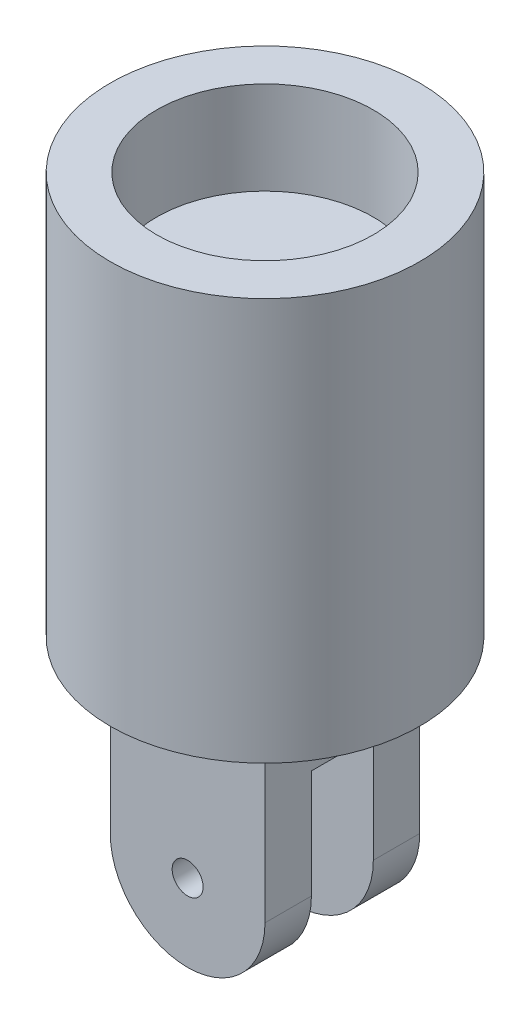
ISO-10303-21;
HEADER;
FILE_DESCRIPTION(('STEP AP214'),'2;1');
FILE_NAME('part.step','',(''),(''),'','','');
FILE_SCHEMA(('AUTOMOTIVE_DESIGN { 1 0 10303 214 1 1 1 1 }'));
ENDSEC;
DATA;
#1=APPLICATION_CONTEXT('core data for automotive mechanical design processes');
#2=APPLICATION_PROTOCOL_DEFINITION('international standard','automotive_design',2000,#1);
#3=PRODUCT_CONTEXT('',#1,'mechanical');
#4=PRODUCT('Part','Part','',(#3));
#5=PRODUCT_RELATED_PRODUCT_CATEGORY('part','',(#4));
#6=PRODUCT_DEFINITION_FORMATION('','',#4);
#7=PRODUCT_DEFINITION_CONTEXT('part definition',#1,'design');
#8=PRODUCT_DEFINITION('design','',#6,#7);
#9=PRODUCT_DEFINITION_SHAPE('','',#8);
#10=(LENGTH_UNIT() NAMED_UNIT(*) SI_UNIT(.MILLI.,.METRE.));
#11=(NAMED_UNIT(*) PLANE_ANGLE_UNIT() SI_UNIT($,.RADIAN.));
#12=(NAMED_UNIT(*) SI_UNIT($,.STERADIAN.) SOLID_ANGLE_UNIT());
#13=UNCERTAINTY_MEASURE_WITH_UNIT(LENGTH_MEASURE(1.E-05),#10,'distance_accuracy_value','');
#14=(GEOMETRIC_REPRESENTATION_CONTEXT(3) GLOBAL_UNCERTAINTY_ASSIGNED_CONTEXT((#13)) GLOBAL_UNIT_ASSIGNED_CONTEXT((#10,
#11,#12)) REPRESENTATION_CONTEXT('',''));
#15=CARTESIAN_POINT('',(0.,0.,0.));
#16=DIRECTION('',(0.,0.,1.));
#17=DIRECTION('',(1.,0.,0.));
#18=AXIS2_PLACEMENT_3D('',#15,#16,#17);
#19=CARTESIAN_POINT('',(0.,13.,0.));
#20=DIRECTION('',(0.,-1.,0.));
#21=DIRECTION('',(0.,0.,-1.));
#22=AXIS2_PLACEMENT_3D('',#19,#20,#21);
#23=CYLINDRICAL_SURFACE('',#22,5.);
#24=CARTESIAN_POINT('',(0.,13.,0.));
#25=DIRECTION('',(0.,1.,0.));
#26=DIRECTION('',(0.,0.,1.));
#27=AXIS2_PLACEMENT_3D('',#24,#25,#26);
#28=CIRCLE('',#27,5.);
#29=CARTESIAN_POINT('',(0.,13.,-5.));
#30=VERTEX_POINT('',#29);
#31=EDGE_CURVE('E170',#30,#30,#28,.T.);
#32=CARTESIAN_POINT('',(0.,0.,0.));
#33=DIRECTION('',(0.,1.,0.));
#34=DIRECTION('',(0.,0.,1.));
#35=AXIS2_PLACEMENT_3D('',#32,#33,#34);
#36=CIRCLE('',#35,5.);
#37=CARTESIAN_POINT('',(0.,0.,-5.));
#38=VERTEX_POINT('',#37);
#39=EDGE_CURVE('E167',#38,#38,#36,.T.);
#40=CARTESIAN_POINT('',(0.,13.,-5.));
#41=CARTESIAN_POINT('',(0.,12.8645833333333,-5.));
#42=CARTESIAN_POINT('',(0.,12.7291666666667,-5.));
#43=CARTESIAN_POINT('',(0.,12.4583333333333,-5.));
#44=CARTESIAN_POINT('',(0.,12.3229166666667,-5.));
#45=CARTESIAN_POINT('',(0.,12.0520833333333,-5.));
#46=CARTESIAN_POINT('',(0.,11.9166666666667,-5.));
#47=CARTESIAN_POINT('',(0.,11.6458333333333,-5.));
#48=CARTESIAN_POINT('',(0.,11.5104166666667,-5.));
#49=CARTESIAN_POINT('',(0.,11.2395833333333,-5.));
#50=CARTESIAN_POINT('',(0.,11.1041666666667,-5.));
#51=CARTESIAN_POINT('',(0.,10.8333333333333,-5.));
#52=CARTESIAN_POINT('',(0.,10.6979166666667,-5.));
#53=CARTESIAN_POINT('',(0.,10.4270833333333,-5.));
#54=CARTESIAN_POINT('',(0.,10.2916666666667,-5.));
#55=CARTESIAN_POINT('',(0.,10.0208333333333,-5.));
#56=CARTESIAN_POINT('',(0.,9.88541666666667,-5.));
#57=CARTESIAN_POINT('',(0.,9.61458333333333,-5.));
#58=CARTESIAN_POINT('',(0.,9.47916666666667,-5.));
#59=CARTESIAN_POINT('',(0.,9.20833333333333,-5.));
#60=CARTESIAN_POINT('',(0.,9.07291666666667,-5.));
#61=CARTESIAN_POINT('',(0.,8.80208333333333,-5.));
#62=CARTESIAN_POINT('',(0.,8.66666666666667,-5.));
#63=CARTESIAN_POINT('',(0.,8.39583333333333,-5.));
#64=CARTESIAN_POINT('',(0.,8.26041666666667,-5.));
#65=CARTESIAN_POINT('',(0.,7.98958333333333,-5.));
#66=CARTESIAN_POINT('',(0.,7.85416666666667,-5.));
#67=CARTESIAN_POINT('',(0.,7.58333333333333,-5.));
#68=CARTESIAN_POINT('',(0.,7.44791666666667,-5.));
#69=CARTESIAN_POINT('',(0.,7.17708333333333,-5.));
#70=CARTESIAN_POINT('',(0.,7.04166666666667,-5.));
#71=CARTESIAN_POINT('',(0.,6.77083333333333,-5.));
#72=CARTESIAN_POINT('',(0.,6.63541666666667,-5.));
#73=CARTESIAN_POINT('',(0.,6.36458333333333,-5.));
#74=CARTESIAN_POINT('',(0.,6.22916666666667,-5.));
#75=CARTESIAN_POINT('',(0.,5.95833333333333,-5.));
#76=CARTESIAN_POINT('',(0.,5.82291666666667,-5.));
#77=CARTESIAN_POINT('',(0.,5.55208333333333,-5.));
#78=CARTESIAN_POINT('',(0.,5.41666666666667,-5.));
#79=CARTESIAN_POINT('',(0.,5.14583333333333,-5.));
#80=CARTESIAN_POINT('',(0.,5.01041666666667,-5.));
#81=CARTESIAN_POINT('',(0.,4.73958333333333,-5.));
#82=CARTESIAN_POINT('',(0.,4.60416666666667,-5.));
#83=CARTESIAN_POINT('',(0.,4.33333333333333,-5.));
#84=CARTESIAN_POINT('',(0.,4.19791666666667,-5.));
#85=CARTESIAN_POINT('',(0.,3.92708333333333,-5.));
#86=CARTESIAN_POINT('',(0.,3.79166666666667,-5.));
#87=CARTESIAN_POINT('',(0.,3.52083333333333,-5.));
#88=CARTESIAN_POINT('',(0.,3.38541666666667,-5.));
#89=CARTESIAN_POINT('',(0.,3.11458333333333,-5.));
#90=CARTESIAN_POINT('',(0.,2.97916666666667,-5.));
#91=CARTESIAN_POINT('',(0.,2.70833333333333,-5.));
#92=CARTESIAN_POINT('',(0.,2.57291666666667,-5.));
#93=CARTESIAN_POINT('',(0.,2.30208333333333,-5.));
#94=CARTESIAN_POINT('',(0.,2.16666666666667,-5.));
#95=CARTESIAN_POINT('',(0.,1.89583333333333,-5.));
#96=CARTESIAN_POINT('',(0.,1.76041666666667,-5.));
#97=CARTESIAN_POINT('',(0.,1.48958333333333,-5.));
#98=CARTESIAN_POINT('',(0.,1.35416666666667,-5.));
#99=CARTESIAN_POINT('',(0.,1.08333333333333,-5.));
#100=CARTESIAN_POINT('',(0.,0.947916666666667,-5.));
#101=CARTESIAN_POINT('',(0.,0.677083333333334,-5.));
#102=CARTESIAN_POINT('',(0.,0.541666666666667,-5.));
#103=CARTESIAN_POINT('',(0.,0.270833333333334,-5.));
#104=CARTESIAN_POINT('',(0.,0.135416666666667,-5.));
#105=CARTESIAN_POINT('',(0.,0.,-5.));
#106=B_SPLINE_CURVE_WITH_KNOTS('',3,(#40,#41,#42,#43,#44,#45,#46,#47,#48,#49,#50,#51,#52,#53,
#54,#55,#56,#57,#58,#59,#60,#61,#62,#63,#64,#65,#66,#67,#68,#69,#70,#71,#72,#73,#74,#75,#76,#77,
#78,#79,#80,#81,#82,#83,#84,#85,#86,#87,#88,#89,#90,#91,#92,#93,#94,#95,#96,#97,#98,#99,#100,
#101,#102,#103,#104,#105),.UNSPECIFIED.,.F.,.F.,(4,2,2,2,2,2,2,2,2,2,2,2,2,2,2,2,2,2,2,2,2,2,2,
2,2,2,2,2,2,2,2,2,4),(0.,0.406249999999999,0.812499999999999,1.21875,1.625,2.03125,2.4375,
2.84375,3.25,3.65625,4.0625,4.46875,4.875,5.28125,5.6875,6.09375,6.5,6.90625,7.3125,7.71875,
8.125,8.53125,8.9375,9.34375,9.75,10.15625,10.5625,10.96875,11.375,11.78125,12.1875,12.59375,
13.),.UNSPECIFIED.);
#107=EDGE_CURVE('BSEAM35',#30,#38,#106,.T.);
#108=ORIENTED_EDGE('',*,*,#31,.F.);
#109=ORIENTED_EDGE('',*,*,#39,.T.);
#110=ORIENTED_EDGE('',*,*,#107,.T.);
#111=ORIENTED_EDGE('',*,*,#107,.F.);
#112=EDGE_LOOP('',(#108,#110,#109,#111));
#113=FACE_BOUND('',#112,.T.);
#114=ADVANCED_FACE('F35',(#113),#23,.T.);
#115=CARTESIAN_POINT('',(0.,13.,0.));
#116=DIRECTION('',(0.,1.,0.));
#117=DIRECTION('',(0.,0.,1.));
#118=AXIS2_PLACEMENT_3D('',#115,#116,#117);
#119=PLANE('',#118);
#120=CARTESIAN_POINT('',(0.,13.,0.));
#121=DIRECTION('',(0.,1.,0.));
#122=DIRECTION('',(0.,0.,1.));
#123=AXIS2_PLACEMENT_3D('',#120,#121,#122);
#124=CIRCLE('',#123,3.5);
#125=CARTESIAN_POINT('',(0.,13.,3.5));
#126=VERTEX_POINT('',#125);
#127=EDGE_CURVE('E158',#126,#126,#124,.T.);
#128=ORIENTED_EDGE('',*,*,#127,.F.);
#129=EDGE_LOOP('',(#128));
#130=FACE_BOUND('',#129,.T.);
#131=ORIENTED_EDGE('',*,*,#31,.T.);
#132=EDGE_LOOP('',(#131));
#133=FACE_BOUND('',#132,.T.);
#134=ADVANCED_FACE('F258',(#130,#133),#119,.T.);
#135=CARTESIAN_POINT('',(0.,0.,0.));
#136=DIRECTION('',(0.,1.,0.));
#137=DIRECTION('',(0.,0.,1.));
#138=AXIS2_PLACEMENT_3D('',#135,#136,#137);
#139=PLANE('',#138);
#140=DIRECTION('',(0.,0.,1.));
#141=VECTOR('',#140,1.);
#142=CARTESIAN_POINT('',(2.5,0.,-2.5));
#143=LINE('',#142,#141);
#144=CARTESIAN_POINT('',(2.5,0.,-2.5));
#145=VERTEX_POINT('',#144);
#146=CARTESIAN_POINT('',(2.5,0.,2.5));
#147=VERTEX_POINT('',#146);
#148=EDGE_CURVE('E152',#145,#147,#143,.T.);
#149=ORIENTED_EDGE('',*,*,#148,.F.);
#150=DIRECTION('',(-1.,0.,0.));
#151=VECTOR('',#150,1.);
#152=CARTESIAN_POINT('',(2.5,0.,-2.5));
#153=LINE('',#152,#151);
#154=CARTESIAN_POINT('',(-2.5,0.,-2.5));
#155=VERTEX_POINT('',#154);
#156=EDGE_CURVE('E142',#145,#155,#153,.T.);
#157=ORIENTED_EDGE('',*,*,#156,.T.);
#158=DIRECTION('',(0.,0.,1.));
#159=VECTOR('',#158,1.);
#160=CARTESIAN_POINT('',(-2.5,0.,-2.5));
#161=LINE('',#160,#159);
#162=CARTESIAN_POINT('',(-2.5,0.,2.5));
#163=VERTEX_POINT('',#162);
#164=EDGE_CURVE('E145',#155,#163,#161,.T.);
#165=ORIENTED_EDGE('',*,*,#164,.T.);
#166=DIRECTION('',(-1.,0.,0.));
#167=VECTOR('',#166,1.);
#168=CARTESIAN_POINT('',(2.5,0.,2.5));
#169=LINE('',#168,#167);
#170=EDGE_CURVE('E149',#147,#163,#169,.T.);
#171=ORIENTED_EDGE('',*,*,#170,.F.);
#172=EDGE_LOOP('',(#149,#157,#165,#171));
#173=FACE_BOUND('',#172,.T.);
#174=ORIENTED_EDGE('',*,*,#39,.F.);
#175=EDGE_LOOP('',(#174));
#176=FACE_BOUND('',#175,.T.);
#177=ADVANCED_FACE('F235',(#173,#176),#139,.F.);
#178=CARTESIAN_POINT('',(0.,10.,0.));
#179=DIRECTION('',(0.,1.,0.));
#180=DIRECTION('',(0.,0.,1.));
#181=AXIS2_PLACEMENT_3D('',#178,#179,#180);
#182=CYLINDRICAL_SURFACE('',#181,3.5);
#183=CARTESIAN_POINT('',(0.,10.,0.));
#184=DIRECTION('',(0.,1.,0.));
#185=DIRECTION('',(0.,0.,1.));
#186=AXIS2_PLACEMENT_3D('',#183,#184,#185);
#187=CIRCLE('',#186,3.5);
#188=CARTESIAN_POINT('',(0.,10.,3.5));
#189=VERTEX_POINT('',#188);
#190=EDGE_CURVE('E164',#189,#189,#187,.T.);
#191=ORIENTED_EDGE('',*,*,#190,.F.);
#192=EDGE_LOOP('',(#191));
#193=FACE_BOUND('',#192,.T.);
#194=ORIENTED_EDGE('',*,*,#127,.T.);
#195=EDGE_LOOP('',(#194));
#196=FACE_BOUND('',#195,.T.);
#197=ADVANCED_FACE('F252',(#193,#196),#182,.F.);
#198=CARTESIAN_POINT('',(0.,10.,0.));
#199=DIRECTION('',(0.,1.,0.));
#200=DIRECTION('',(0.,0.,1.));
#201=AXIS2_PLACEMENT_3D('',#198,#199,#200);
#202=PLANE('',#201);
#203=ORIENTED_EDGE('',*,*,#190,.T.);
#204=EDGE_LOOP('',(#203));
#205=FACE_BOUND('',#204,.T.);
#206=ADVANCED_FACE('F244',(#205),#202,.T.);
#207=CARTESIAN_POINT('',(2.5,-8.,-2.5));
#208=DIRECTION('',(0.,0.,-1.));
#209=DIRECTION('',(-1.,0.,0.));
#210=AXIS2_PLACEMENT_3D('',#207,#208,#209);
#211=PLANE('',#210);
#212=CARTESIAN_POINT('',(0.,-5.5,-2.5));
#213=DIRECTION('',(0.,0.,-1.));
#214=DIRECTION('',(-1.,0.,0.));
#215=AXIS2_PLACEMENT_3D('',#212,#213,#214);
#216=CIRCLE('',#215,0.5);
#217=CARTESIAN_POINT('',(-0.5,-5.5,-2.5));
#218=VERTEX_POINT('',#217);
#219=EDGE_CURVE('E410',#218,#218,#216,.T.);
#220=ORIENTED_EDGE('',*,*,#219,.F.);
#221=EDGE_LOOP('',(#220));
#222=FACE_BOUND('',#221,.T.);
#223=DIRECTION('',(0.,1.,0.));
#224=VECTOR('',#223,1.);
#225=CARTESIAN_POINT('',(2.5,-8.,-2.5));
#226=LINE('',#225,#224);
#227=CARTESIAN_POINT('',(2.5,-5.5,-2.5));
#228=VERTEX_POINT('',#227);
#229=EDGE_CURVE('E156',#228,#145,#226,.T.);
#230=ORIENTED_EDGE('',*,*,#229,.F.);
#231=CARTESIAN_POINT('',(0.,-5.5,-2.5));
#232=DIRECTION('',(0.,0.,-1.));
#233=DIRECTION('',(-1.,0.,0.));
#234=AXIS2_PLACEMENT_3D('',#231,#232,#233);
#235=CIRCLE('',#234,2.5);
#236=CARTESIAN_POINT('',(0.,-8.,-2.5));
#237=VERTEX_POINT('',#236);
#238=EDGE_CURVE('E11',#228,#237,#235,.T.);
#239=ORIENTED_EDGE('',*,*,#238,.T.);
#240=CARTESIAN_POINT('',(0.,-5.5,-2.5));
#241=DIRECTION('',(0.,0.,-1.));
#242=DIRECTION('',(-1.,0.,0.));
#243=AXIS2_PLACEMENT_3D('',#240,#241,#242);
#244=CIRCLE('',#243,2.5);
#245=CARTESIAN_POINT('',(-2.5,-5.5,-2.5));
#246=VERTEX_POINT('',#245);
#247=EDGE_CURVE('E44',#237,#246,#244,.T.);
#248=ORIENTED_EDGE('',*,*,#247,.T.);
#249=DIRECTION('',(0.,1.,0.));
#250=VECTOR('',#249,1.);
#251=CARTESIAN_POINT('',(-2.5,-8.,-2.5));
#252=LINE('',#251,#250);
#253=EDGE_CURVE('E155',#246,#155,#252,.T.);
#254=ORIENTED_EDGE('',*,*,#253,.T.);
#255=ORIENTED_EDGE('',*,*,#156,.F.);
#256=EDGE_LOOP('',(#230,#239,#248,#254,#255));
#257=FACE_BOUND('',#256,.T.);
#258=ADVANCED_FACE('F242',(#222,#257),#211,.T.);
#259=CARTESIAN_POINT('',(2.5,-8.,-2.5));
#260=DIRECTION('',(-1.,0.,0.));
#261=DIRECTION('',(0.,0.,1.));
#262=AXIS2_PLACEMENT_3D('',#259,#260,#261);
#263=PLANE('',#262);
#264=DIRECTION('',(0.,1.,0.));
#265=VECTOR('',#264,1.);
#266=CARTESIAN_POINT('',(2.5,-8.,2.5));
#267=LINE('',#266,#265);
#268=CARTESIAN_POINT('',(2.5,-5.5,2.5));
#269=VERTEX_POINT('',#268);
#270=EDGE_CURVE('E159',#269,#147,#267,.T.);
#271=ORIENTED_EDGE('',*,*,#270,.F.);
#272=DIRECTION('',(0.,0.,1.));
#273=VECTOR('',#272,1.);
#274=CARTESIAN_POINT('',(2.5,-5.5,-2.5));
#275=LINE('',#274,#273);
#276=CARTESIAN_POINT('',(2.5,-5.5,1.));
#277=VERTEX_POINT('',#276);
#278=EDGE_CURVE('E190',#269,#277,#275,.F.);
#279=ORIENTED_EDGE('',*,*,#278,.T.);
#280=DIRECTION('',(0.,-1.,0.));
#281=VECTOR('',#280,1.);
#282=CARTESIAN_POINT('',(2.5,-2.,1.));
#283=LINE('',#282,#281);
#284=CARTESIAN_POINT('',(2.5,-2.,1.));
#285=VERTEX_POINT('',#284);
#286=EDGE_CURVE('E137',#285,#277,#283,.T.);
#287=ORIENTED_EDGE('',*,*,#286,.F.);
#288=DIRECTION('',(0.,0.,1.));
#289=VECTOR('',#288,1.);
#290=CARTESIAN_POINT('',(2.5,-2.,-1.));
#291=LINE('',#290,#289);
#292=CARTESIAN_POINT('',(2.5,-2.,-1.));
#293=VERTEX_POINT('',#292);
#294=EDGE_CURVE('E120',#293,#285,#291,.T.);
#295=ORIENTED_EDGE('',*,*,#294,.F.);
#296=DIRECTION('',(0.,-1.,0.));
#297=VECTOR('',#296,1.);
#298=CARTESIAN_POINT('',(2.5,-2.,-1.));
#299=LINE('',#298,#297);
#300=CARTESIAN_POINT('',(2.5,-5.5,-1.));
#301=VERTEX_POINT('',#300);
#302=EDGE_CURVE('E117',#293,#301,#299,.T.);
#303=ORIENTED_EDGE('',*,*,#302,.T.);
#304=DIRECTION('',(0.,0.,1.));
#305=VECTOR('',#304,1.);
#306=CARTESIAN_POINT('',(2.5,-5.5,-2.5));
#307=LINE('',#306,#305);
#308=EDGE_CURVE('E187',#301,#228,#307,.F.);
#309=ORIENTED_EDGE('',*,*,#308,.T.);
#310=ORIENTED_EDGE('',*,*,#229,.T.);
#311=ORIENTED_EDGE('',*,*,#148,.T.);
#312=EDGE_LOOP('',(#271,#279,#287,#295,#303,#309,#310,#311));
#313=FACE_BOUND('',#312,.T.);
#314=ADVANCED_FACE('F241',(#313),#263,.F.);
#315=CARTESIAN_POINT('',(2.5,-8.,2.5));
#316=DIRECTION('',(0.,0.,-1.));
#317=DIRECTION('',(-1.,0.,0.));
#318=AXIS2_PLACEMENT_3D('',#315,#316,#317);
#319=PLANE('',#318);
#320=CARTESIAN_POINT('',(0.,-5.5,2.5));
#321=DIRECTION('',(0.,0.,-1.));
#322=DIRECTION('',(-1.,0.,0.));
#323=AXIS2_PLACEMENT_3D('',#320,#321,#322);
#324=CIRCLE('',#323,0.5);
#325=CARTESIAN_POINT('',(-0.5,-5.5,2.5));
#326=VERTEX_POINT('',#325);
#327=EDGE_CURVE('E199',#326,#326,#324,.T.);
#328=ORIENTED_EDGE('',*,*,#327,.T.);
#329=EDGE_LOOP('',(#328));
#330=FACE_BOUND('',#329,.T.);
#331=DIRECTION('',(0.,1.,0.));
#332=VECTOR('',#331,1.);
#333=CARTESIAN_POINT('',(-2.5,-8.,2.5));
#334=LINE('',#333,#332);
#335=CARTESIAN_POINT('',(-2.5,-5.5,2.5));
#336=VERTEX_POINT('',#335);
#337=EDGE_CURVE('E161',#336,#163,#334,.T.);
#338=ORIENTED_EDGE('',*,*,#337,.F.);
#339=CARTESIAN_POINT('',(0.,-5.5,2.5));
#340=DIRECTION('',(0.,0.,-1.));
#341=DIRECTION('',(-1.,0.,0.));
#342=AXIS2_PLACEMENT_3D('',#339,#340,#341);
#343=CIRCLE('',#342,2.5);
#344=CARTESIAN_POINT('',(0.,-8.,2.5));
#345=VERTEX_POINT('',#344);
#346=EDGE_CURVE('E181',#336,#345,#343,.F.);
#347=ORIENTED_EDGE('',*,*,#346,.T.);
#348=CARTESIAN_POINT('',(0.,-5.5,2.5));
#349=DIRECTION('',(0.,0.,-1.));
#350=DIRECTION('',(-1.,0.,0.));
#351=AXIS2_PLACEMENT_3D('',#348,#349,#350);
#352=CIRCLE('',#351,2.5);
#353=EDGE_CURVE('E179',#345,#269,#352,.F.);
#354=ORIENTED_EDGE('',*,*,#353,.T.);
#355=ORIENTED_EDGE('',*,*,#270,.T.);
#356=ORIENTED_EDGE('',*,*,#170,.T.);
#357=EDGE_LOOP('',(#338,#347,#354,#355,#356));
#358=FACE_BOUND('',#357,.T.);
#359=ADVANCED_FACE('F230',(#330,#358),#319,.F.);
#360=CARTESIAN_POINT('',(-2.5,-8.,-2.5));
#361=DIRECTION('',(-1.,0.,0.));
#362=DIRECTION('',(0.,0.,1.));
#363=AXIS2_PLACEMENT_3D('',#360,#361,#362);
#364=PLANE('',#363);
#365=DIRECTION('',(0.,-1.,0.));
#366=VECTOR('',#365,1.);
#367=CARTESIAN_POINT('',(-2.5,-2.,1.));
#368=LINE('',#367,#366);
#369=CARTESIAN_POINT('',(-2.5,-2.,1.));
#370=VERTEX_POINT('',#369);
#371=CARTESIAN_POINT('',(-2.5,-5.5,1.));
#372=VERTEX_POINT('',#371);
#373=EDGE_CURVE('E146',#370,#372,#368,.T.);
#374=ORIENTED_EDGE('',*,*,#373,.T.);
#375=DIRECTION('',(0.,0.,1.));
#376=VECTOR('',#375,1.);
#377=CARTESIAN_POINT('',(-2.5,-5.5,2.5));
#378=LINE('',#377,#376);
#379=EDGE_CURVE('E176',#372,#336,#378,.T.);
#380=ORIENTED_EDGE('',*,*,#379,.T.);
#381=ORIENTED_EDGE('',*,*,#337,.T.);
#382=ORIENTED_EDGE('',*,*,#164,.F.);
#383=ORIENTED_EDGE('',*,*,#253,.F.);
#384=DIRECTION('',(0.,0.,1.));
#385=VECTOR('',#384,1.);
#386=CARTESIAN_POINT('',(-2.5,-5.5,-1.));
#387=LINE('',#386,#385);
#388=CARTESIAN_POINT('',(-2.5,-5.5,-1.));
#389=VERTEX_POINT('',#388);
#390=EDGE_CURVE('E135',#246,#389,#387,.T.);
#391=ORIENTED_EDGE('',*,*,#390,.T.);
#392=DIRECTION('',(0.,-1.,0.));
#393=VECTOR('',#392,1.);
#394=CARTESIAN_POINT('',(-2.5,-2.,-1.));
#395=LINE('',#394,#393);
#396=CARTESIAN_POINT('',(-2.5,-2.,-1.));
#397=VERTEX_POINT('',#396);
#398=EDGE_CURVE('E115',#397,#389,#395,.T.);
#399=ORIENTED_EDGE('',*,*,#398,.F.);
#400=DIRECTION('',(0.,0.,-1.));
#401=VECTOR('',#400,1.);
#402=CARTESIAN_POINT('',(-2.5,-2.,-1.));
#403=LINE('',#402,#401);
#404=EDGE_CURVE('E121',#370,#397,#403,.T.);
#405=ORIENTED_EDGE('',*,*,#404,.F.);
#406=EDGE_LOOP('',(#374,#380,#381,#382,#383,#391,#399,#405));
#407=FACE_BOUND('',#406,.T.);
#408=ADVANCED_FACE('F132',(#407),#364,.T.);
#409=CARTESIAN_POINT('',(2.5,-2.,1.));
#410=DIRECTION('',(0.,0.,1.));
#411=DIRECTION('',(1.,0.,0.));
#412=AXIS2_PLACEMENT_3D('',#409,#410,#411);
#413=PLANE('',#412);
#414=CARTESIAN_POINT('',(0.,-5.5,1.));
#415=DIRECTION('',(0.,0.,1.));
#416=DIRECTION('',(1.,0.,0.));
#417=AXIS2_PLACEMENT_3D('',#414,#415,#416);
#418=CIRCLE('',#417,0.5);
#419=CARTESIAN_POINT('',(0.5,-5.5,1.));
#420=VERTEX_POINT('',#419);
#421=EDGE_CURVE('E203',#420,#420,#418,.T.);
#422=ORIENTED_EDGE('',*,*,#421,.T.);
#423=EDGE_LOOP('',(#422));
#424=FACE_BOUND('',#423,.T.);
#425=CARTESIAN_POINT('',(0.,-5.5,1.));
#426=DIRECTION('',(0.,0.,1.));
#427=DIRECTION('',(1.,0.,0.));
#428=AXIS2_PLACEMENT_3D('',#425,#426,#427);
#429=CIRCLE('',#428,2.5);
#430=CARTESIAN_POINT('',(0.,-8.,1.));
#431=VERTEX_POINT('',#430);
#432=EDGE_CURVE('E183',#277,#431,#429,.F.);
#433=ORIENTED_EDGE('',*,*,#432,.T.);
#434=CARTESIAN_POINT('',(0.,-5.5,1.));
#435=DIRECTION('',(0.,0.,1.));
#436=DIRECTION('',(1.,0.,0.));
#437=AXIS2_PLACEMENT_3D('',#434,#435,#436);
#438=CIRCLE('',#437,2.5);
#439=EDGE_CURVE('E185',#431,#372,#438,.F.);
#440=ORIENTED_EDGE('',*,*,#439,.T.);
#441=ORIENTED_EDGE('',*,*,#373,.F.);
#442=DIRECTION('',(-1.,0.,0.));
#443=VECTOR('',#442,1.);
#444=CARTESIAN_POINT('',(2.5,-2.,1.));
#445=LINE('',#444,#443);
#446=EDGE_CURVE('E127',#285,#370,#445,.T.);
#447=ORIENTED_EDGE('',*,*,#446,.F.);
#448=ORIENTED_EDGE('',*,*,#286,.T.);
#449=EDGE_LOOP('',(#433,#440,#441,#447,#448));
#450=FACE_BOUND('',#449,.T.);
#451=ADVANCED_FACE('F216',(#424,#450),#413,.F.);
#452=CARTESIAN_POINT('',(2.5,-2.,-1.));
#453=DIRECTION('',(0.,0.,-1.));
#454=DIRECTION('',(-1.,0.,0.));
#455=AXIS2_PLACEMENT_3D('',#452,#453,#454);
#456=PLANE('',#455);
#457=CARTESIAN_POINT('',(0.,-5.5,-1.));
#458=DIRECTION('',(0.,0.,-1.));
#459=DIRECTION('',(-1.,0.,0.));
#460=AXIS2_PLACEMENT_3D('',#457,#458,#459);
#461=CIRCLE('',#460,0.5);
#462=CARTESIAN_POINT('',(-0.5,-5.5,-1.));
#463=VERTEX_POINT('',#462);
#464=EDGE_CURVE('E39',#463,#463,#461,.T.);
#465=ORIENTED_EDGE('',*,*,#464,.T.);
#466=EDGE_LOOP('',(#465));
#467=FACE_BOUND('',#466,.T.);
#468=CARTESIAN_POINT('',(0.,-5.5,-1.));
#469=DIRECTION('',(0.,0.,-1.));
#470=DIRECTION('',(-1.,0.,0.));
#471=AXIS2_PLACEMENT_3D('',#468,#469,#470);
#472=CIRCLE('',#471,2.5);
#473=CARTESIAN_POINT('',(0.,-8.,-1.));
#474=VERTEX_POINT('',#473);
#475=EDGE_CURVE('E58',#389,#474,#472,.F.);
#476=ORIENTED_EDGE('',*,*,#475,.T.);
#477=CARTESIAN_POINT('',(0.,-5.5,-1.));
#478=DIRECTION('',(0.,0.,-1.));
#479=DIRECTION('',(-1.,0.,0.));
#480=AXIS2_PLACEMENT_3D('',#477,#478,#479);
#481=CIRCLE('',#480,2.5);
#482=EDGE_CURVE('E193',#474,#301,#481,.F.);
#483=ORIENTED_EDGE('',*,*,#482,.T.);
#484=ORIENTED_EDGE('',*,*,#302,.F.);
#485=DIRECTION('',(1.,0.,0.));
#486=VECTOR('',#485,1.);
#487=CARTESIAN_POINT('',(2.5,-2.,-1.));
#488=LINE('',#487,#486);
#489=EDGE_CURVE('E111',#397,#293,#488,.T.);
#490=ORIENTED_EDGE('',*,*,#489,.F.);
#491=ORIENTED_EDGE('',*,*,#398,.T.);
#492=EDGE_LOOP('',(#476,#483,#484,#490,#491));
#493=FACE_BOUND('',#492,.T.);
#494=ADVANCED_FACE('F113',(#467,#493),#456,.F.);
#495=CARTESIAN_POINT('',(0.,-2.,0.));
#496=DIRECTION('',(0.,-1.,0.));
#497=DIRECTION('',(0.,0.,-1.));
#498=AXIS2_PLACEMENT_3D('',#495,#496,#497);
#499=PLANE('',#498);
#500=ORIENTED_EDGE('',*,*,#404,.T.);
#501=ORIENTED_EDGE('',*,*,#489,.T.);
#502=ORIENTED_EDGE('',*,*,#294,.T.);
#503=ORIENTED_EDGE('',*,*,#446,.T.);
#504=EDGE_LOOP('',(#500,#501,#502,#503));
#505=FACE_BOUND('',#504,.T.);
#506=ADVANCED_FACE('F125',(#505),#499,.T.);
#507=CARTESIAN_POINT('',(0.,-5.5,0.));
#508=DIRECTION('',(0.,0.,1.));
#509=DIRECTION('',(1.,0.,0.));
#510=AXIS2_PLACEMENT_3D('',#507,#508,#509);
#511=CYLINDRICAL_SURFACE('',#510,2.5);
#512=DIRECTION('',(0.,0.,1.));
#513=VECTOR('',#512,1.);
#514=CARTESIAN_POINT('',(0.,-8.,0.));
#515=LINE('',#514,#513);
#516=EDGE_CURVE('E130',#431,#345,#515,.T.);
#517=ORIENTED_EDGE('',*,*,#516,.F.);
#518=ORIENTED_EDGE('',*,*,#432,.F.);
#519=ORIENTED_EDGE('',*,*,#278,.F.);
#520=ORIENTED_EDGE('',*,*,#353,.F.);
#521=EDGE_LOOP('',(#517,#518,#519,#520));
#522=FACE_BOUND('',#521,.T.);
#523=ADVANCED_FACE('F221',(#522),#511,.T.);
#524=CARTESIAN_POINT('',(0.,-5.5,-2.5));
#525=DIRECTION('',(0.,0.,-1.));
#526=DIRECTION('',(-1.,0.,0.));
#527=AXIS2_PLACEMENT_3D('',#524,#525,#526);
#528=CYLINDRICAL_SURFACE('',#527,2.5);
#529=ORIENTED_EDGE('',*,*,#439,.F.);
#530=ORIENTED_EDGE('',*,*,#516,.T.);
#531=ORIENTED_EDGE('',*,*,#346,.F.);
#532=ORIENTED_EDGE('',*,*,#379,.F.);
#533=EDGE_LOOP('',(#529,#530,#531,#532));
#534=FACE_BOUND('',#533,.T.);
#535=ADVANCED_FACE('F226',(#534),#528,.T.);
#536=CARTESIAN_POINT('',(0.,-5.5,-2.5));
#537=DIRECTION('',(0.,0.,-1.));
#538=DIRECTION('',(-1.,0.,0.));
#539=AXIS2_PLACEMENT_3D('',#536,#537,#538);
#540=CYLINDRICAL_SURFACE('',#539,2.5);
#541=ORIENTED_EDGE('',*,*,#390,.F.);
#542=ORIENTED_EDGE('',*,*,#247,.F.);
#543=DIRECTION('',(0.,0.,1.));
#544=VECTOR('',#543,1.);
#545=CARTESIAN_POINT('',(0.,-8.,-2.5));
#546=LINE('',#545,#544);
#547=EDGE_CURVE('E197',#474,#237,#546,.F.);
#548=ORIENTED_EDGE('',*,*,#547,.F.);
#549=ORIENTED_EDGE('',*,*,#475,.F.);
#550=EDGE_LOOP('',(#541,#542,#548,#549));
#551=FACE_BOUND('',#550,.T.);
#552=ADVANCED_FACE('F37',(#551),#540,.T.);
#553=CARTESIAN_POINT('',(0.,-5.5,0.));
#554=DIRECTION('',(0.,0.,1.));
#555=DIRECTION('',(1.,0.,0.));
#556=AXIS2_PLACEMENT_3D('',#553,#554,#555);
#557=CYLINDRICAL_SURFACE('',#556,2.5);
#558=ORIENTED_EDGE('',*,*,#238,.F.);
#559=ORIENTED_EDGE('',*,*,#308,.F.);
#560=ORIENTED_EDGE('',*,*,#482,.F.);
#561=ORIENTED_EDGE('',*,*,#547,.T.);
#562=EDGE_LOOP('',(#558,#559,#560,#561));
#563=FACE_BOUND('',#562,.T.);
#564=ADVANCED_FACE('F240',(#563),#557,.T.);
#565=CARTESIAN_POINT('',(0.,-5.5,5.));
#566=DIRECTION('',(0.,0.,-1.));
#567=DIRECTION('',(-1.,0.,0.));
#568=AXIS2_PLACEMENT_3D('',#565,#566,#567);
#569=CYLINDRICAL_SURFACE('',#568,0.5);
#570=ORIENTED_EDGE('',*,*,#219,.T.);
#571=EDGE_LOOP('',(#570));
#572=FACE_BOUND('',#571,.T.);
#573=ORIENTED_EDGE('',*,*,#464,.F.);
#574=EDGE_LOOP('',(#573));
#575=FACE_BOUND('',#574,.T.);
#576=ADVANCED_FACE('F274',(#572,#575),#569,.F.);
#577=ORIENTED_EDGE('',*,*,#421,.F.);
#578=EDGE_LOOP('',(#577));
#579=FACE_BOUND('',#578,.T.);
#580=ORIENTED_EDGE('',*,*,#327,.F.);
#581=EDGE_LOOP('',(#580));
#582=FACE_BOUND('',#581,.T.);
#583=ADVANCED_FACE('F279',(#579,#582),#569,.F.);
#584=CLOSED_SHELL('',(#114,#134,#177,#197,#206,#258,#314,#359,#408,#451,#494,#506,#523,#535,
#552,#564,#576,#583));
#585=MANIFOLD_SOLID_BREP('B2',#584);
#586=ADVANCED_BREP_SHAPE_REPRESENTATION('',(#18,#585),#14);
#587=SHAPE_DEFINITION_REPRESENTATION(#9,#586);
ENDSEC;
END-ISO-10303-21;
